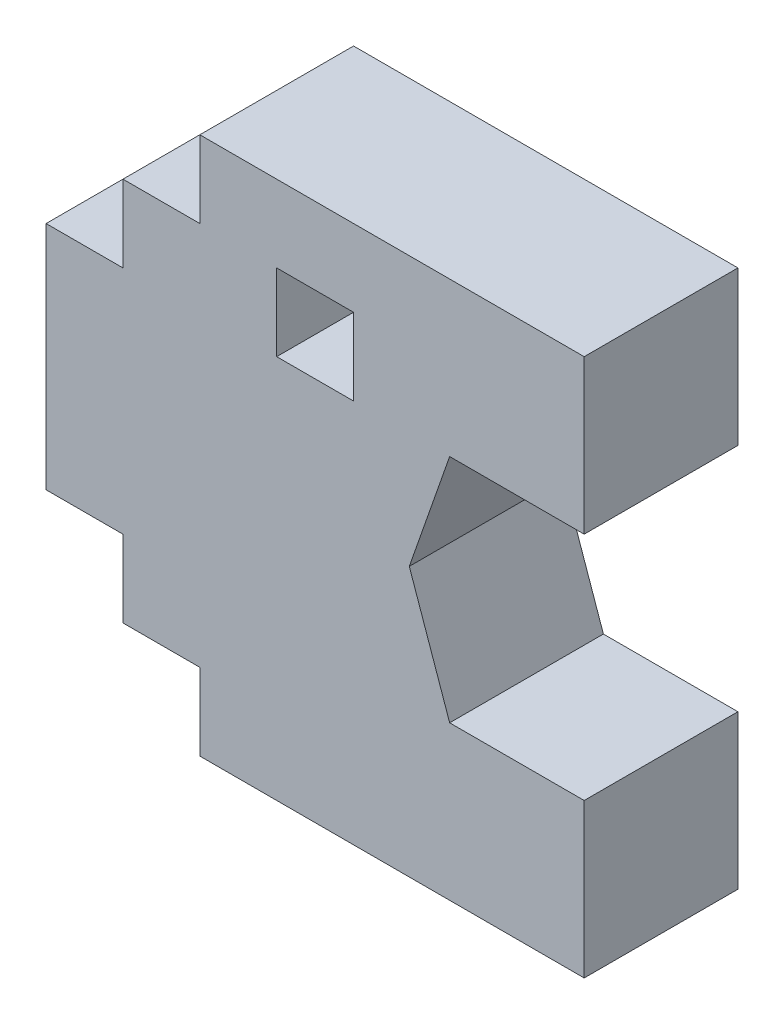
ISO-10303-21;
HEADER;
FILE_DESCRIPTION(('STEP AP214'),'2;1');
FILE_NAME('part.step','',(''),(''),'','','');
FILE_SCHEMA(('AUTOMOTIVE_DESIGN { 1 0 10303 214 1 1 1 1 }'));
ENDSEC;
DATA;
#1=APPLICATION_CONTEXT('core data for automotive mechanical design processes');
#2=APPLICATION_PROTOCOL_DEFINITION('international standard','automotive_design',2000,#1);
#3=PRODUCT_CONTEXT('',#1,'mechanical');
#4=PRODUCT('Part','Part','',(#3));
#5=PRODUCT_RELATED_PRODUCT_CATEGORY('part','',(#4));
#6=PRODUCT_DEFINITION_FORMATION('','',#4);
#7=PRODUCT_DEFINITION_CONTEXT('part definition',#1,'design');
#8=PRODUCT_DEFINITION('design','',#6,#7);
#9=PRODUCT_DEFINITION_SHAPE('','',#8);
#10=(LENGTH_UNIT() NAMED_UNIT(*) SI_UNIT(.MILLI.,.METRE.));
#11=(NAMED_UNIT(*) PLANE_ANGLE_UNIT() SI_UNIT($,.RADIAN.));
#12=(NAMED_UNIT(*) SI_UNIT($,.STERADIAN.) SOLID_ANGLE_UNIT());
#13=UNCERTAINTY_MEASURE_WITH_UNIT(LENGTH_MEASURE(1.E-05),#10,'distance_accuracy_value','');
#14=(GEOMETRIC_REPRESENTATION_CONTEXT(3) GLOBAL_UNCERTAINTY_ASSIGNED_CONTEXT((#13)) GLOBAL_UNIT_ASSIGNED_CONTEXT((#10,
#11,#12)) REPRESENTATION_CONTEXT('',''));
#15=CARTESIAN_POINT('',(0.,0.,0.));
#16=DIRECTION('',(0.,0.,1.));
#17=DIRECTION('',(1.,0.,0.));
#18=AXIS2_PLACEMENT_3D('',#15,#16,#17);
#19=CARTESIAN_POINT('',(30.,140.,40.));
#20=DIRECTION('',(0.,1.,0.));
#21=DIRECTION('',(0.,0.,1.));
#22=AXIS2_PLACEMENT_3D('',#19,#20,#21);
#23=PLANE('',#22);
#24=DIRECTION('',(1.,0.,0.));
#25=VECTOR('',#24,1.);
#26=CARTESIAN_POINT('',(30.,140.,0.));
#27=LINE('',#26,#25);
#28=CARTESIAN_POINT('',(0.,140.,0.));
#29=VERTEX_POINT('',#28);
#30=CARTESIAN_POINT('',(100.,140.,0.));
#31=VERTEX_POINT('',#30);
#32=EDGE_CURVE('E203',#29,#31,#27,.T.);
#33=ORIENTED_EDGE('',*,*,#32,.F.);
#34=DIRECTION('',(0.,0.,-1.));
#35=VECTOR('',#34,1.);
#36=CARTESIAN_POINT('',(0.,140.,40.));
#37=LINE('',#36,#35);
#38=CARTESIAN_POINT('',(0.,140.,40.));
#39=VERTEX_POINT('',#38);
#40=EDGE_CURVE('E11',#39,#29,#37,.T.);
#41=ORIENTED_EDGE('',*,*,#40,.F.);
#42=DIRECTION('',(1.,0.,0.));
#43=VECTOR('',#42,1.);
#44=CARTESIAN_POINT('',(30.,140.,40.));
#45=LINE('',#44,#43);
#46=CARTESIAN_POINT('',(100.,140.,40.));
#47=VERTEX_POINT('',#46);
#48=EDGE_CURVE('E261',#39,#47,#45,.T.);
#49=ORIENTED_EDGE('',*,*,#48,.T.);
#50=DIRECTION('',(0.,0.,-1.));
#51=VECTOR('',#50,1.);
#52=CARTESIAN_POINT('',(100.,140.,40.));
#53=LINE('',#52,#51);
#54=EDGE_CURVE('E47',#47,#31,#53,.T.);
#55=ORIENTED_EDGE('',*,*,#54,.T.);
#56=EDGE_LOOP('',(#33,#41,#49,#55));
#57=FACE_BOUND('',#56,.T.);
#58=ADVANCED_FACE('F30',(#57),#23,.T.);
#59=CARTESIAN_POINT('',(0.,-84.1414213562373,40.));
#60=DIRECTION('',(-1.,0.,0.));
#61=DIRECTION('',(0.,-1.,0.));
#62=AXIS2_PLACEMENT_3D('',#59,#60,#61);
#63=PLANE('',#62);
#64=DIRECTION('',(0.,1.,0.));
#65=VECTOR('',#64,1.);
#66=CARTESIAN_POINT('',(0.,-84.1414213562373,0.));
#67=LINE('',#66,#65);
#68=CARTESIAN_POINT('',(0.,120.,0.));
#69=VERTEX_POINT('',#68);
#70=EDGE_CURVE('E206',#69,#29,#67,.T.);
#71=ORIENTED_EDGE('',*,*,#70,.F.);
#72=DIRECTION('',(0.,0.,-1.));
#73=VECTOR('',#72,1.);
#74=CARTESIAN_POINT('',(0.,120.,40.));
#75=LINE('',#74,#73);
#76=CARTESIAN_POINT('',(0.,120.,40.));
#77=VERTEX_POINT('',#76);
#78=EDGE_CURVE('E39',#77,#69,#75,.T.);
#79=ORIENTED_EDGE('',*,*,#78,.F.);
#80=DIRECTION('',(0.,1.,0.));
#81=VECTOR('',#80,1.);
#82=CARTESIAN_POINT('',(0.,-84.1414213562373,40.));
#83=LINE('',#82,#81);
#84=EDGE_CURVE('E263',#77,#39,#83,.T.);
#85=ORIENTED_EDGE('',*,*,#84,.T.);
#86=ORIENTED_EDGE('',*,*,#40,.T.);
#87=EDGE_LOOP('',(#71,#79,#85,#86));
#88=FACE_BOUND('',#87,.T.);
#89=ADVANCED_FACE('F369',(#88),#63,.T.);
#90=CARTESIAN_POINT('',(30.,120.,40.));
#91=DIRECTION('',(0.,1.,0.));
#92=DIRECTION('',(0.,0.,1.));
#93=AXIS2_PLACEMENT_3D('',#90,#91,#92);
#94=PLANE('',#93);
#95=DIRECTION('',(1.,0.,0.));
#96=VECTOR('',#95,1.);
#97=CARTESIAN_POINT('',(30.,120.,0.));
#98=LINE('',#97,#96);
#99=CARTESIAN_POINT('',(-20.,120.,0.));
#100=VERTEX_POINT('',#99);
#101=EDGE_CURVE('E209',#100,#69,#98,.T.);
#102=ORIENTED_EDGE('',*,*,#101,.F.);
#103=DIRECTION('',(0.,0.,-1.));
#104=VECTOR('',#103,1.);
#105=CARTESIAN_POINT('',(-20.,120.,40.));
#106=LINE('',#105,#104);
#107=CARTESIAN_POINT('',(-20.,120.,40.));
#108=VERTEX_POINT('',#107);
#109=EDGE_CURVE('E342',#108,#100,#106,.T.);
#110=ORIENTED_EDGE('',*,*,#109,.F.);
#111=DIRECTION('',(1.,0.,0.));
#112=VECTOR('',#111,1.);
#113=CARTESIAN_POINT('',(30.,120.,40.));
#114=LINE('',#113,#112);
#115=EDGE_CURVE('E266',#108,#77,#114,.T.);
#116=ORIENTED_EDGE('',*,*,#115,.T.);
#117=ORIENTED_EDGE('',*,*,#78,.T.);
#118=EDGE_LOOP('',(#102,#110,#116,#117));
#119=FACE_BOUND('',#118,.T.);
#120=ADVANCED_FACE('F374',(#119),#94,.T.);
#121=CARTESIAN_POINT('',(-20.,-84.1414213562373,40.));
#122=DIRECTION('',(-1.,0.,0.));
#123=DIRECTION('',(0.,-1.,0.));
#124=AXIS2_PLACEMENT_3D('',#121,#122,#123);
#125=PLANE('',#124);
#126=DIRECTION('',(0.,1.,0.));
#127=VECTOR('',#126,1.);
#128=CARTESIAN_POINT('',(-20.,-84.1414213562373,0.));
#129=LINE('',#128,#127);
#130=CARTESIAN_POINT('',(-20.,100.,0.));
#131=VERTEX_POINT('',#130);
#132=EDGE_CURVE('E212',#131,#100,#129,.T.);
#133=ORIENTED_EDGE('',*,*,#132,.F.);
#134=DIRECTION('',(0.,0.,-1.));
#135=VECTOR('',#134,1.);
#136=CARTESIAN_POINT('',(-20.,100.,40.));
#137=LINE('',#136,#135);
#138=CARTESIAN_POINT('',(-20.,100.,40.));
#139=VERTEX_POINT('',#138);
#140=EDGE_CURVE('E340',#139,#131,#137,.T.);
#141=ORIENTED_EDGE('',*,*,#140,.F.);
#142=DIRECTION('',(0.,1.,0.));
#143=VECTOR('',#142,1.);
#144=CARTESIAN_POINT('',(-20.,-84.1414213562373,40.));
#145=LINE('',#144,#143);
#146=EDGE_CURVE('E269',#139,#108,#145,.T.);
#147=ORIENTED_EDGE('',*,*,#146,.T.);
#148=ORIENTED_EDGE('',*,*,#109,.T.);
#149=EDGE_LOOP('',(#133,#141,#147,#148));
#150=FACE_BOUND('',#149,.T.);
#151=ADVANCED_FACE('F381',(#150),#125,.T.);
#152=CARTESIAN_POINT('',(30.,100.,40.));
#153=DIRECTION('',(0.,1.,0.));
#154=DIRECTION('',(0.,0.,1.));
#155=AXIS2_PLACEMENT_3D('',#152,#153,#154);
#156=PLANE('',#155);
#157=DIRECTION('',(1.,0.,0.));
#158=VECTOR('',#157,1.);
#159=CARTESIAN_POINT('',(30.,100.,0.));
#160=LINE('',#159,#158);
#161=CARTESIAN_POINT('',(-40.,100.,0.));
#162=VERTEX_POINT('',#161);
#163=EDGE_CURVE('E215',#162,#131,#160,.T.);
#164=ORIENTED_EDGE('',*,*,#163,.F.);
#165=DIRECTION('',(0.,0.,-1.));
#166=VECTOR('',#165,1.);
#167=CARTESIAN_POINT('',(-40.,100.,40.));
#168=LINE('',#167,#166);
#169=CARTESIAN_POINT('',(-40.,100.,40.));
#170=VERTEX_POINT('',#169);
#171=EDGE_CURVE('E338',#170,#162,#168,.T.);
#172=ORIENTED_EDGE('',*,*,#171,.F.);
#173=DIRECTION('',(1.,0.,0.));
#174=VECTOR('',#173,1.);
#175=CARTESIAN_POINT('',(30.,100.,40.));
#176=LINE('',#175,#174);
#177=EDGE_CURVE('E272',#170,#139,#176,.T.);
#178=ORIENTED_EDGE('',*,*,#177,.T.);
#179=ORIENTED_EDGE('',*,*,#140,.T.);
#180=EDGE_LOOP('',(#164,#172,#178,#179));
#181=FACE_BOUND('',#180,.T.);
#182=ADVANCED_FACE('F385',(#181),#156,.T.);
#183=CARTESIAN_POINT('',(-40.,-84.1414213562373,40.));
#184=DIRECTION('',(1.,0.,0.));
#185=DIRECTION('',(0.,0.,-1.));
#186=AXIS2_PLACEMENT_3D('',#183,#184,#185);
#187=PLANE('',#186);
#188=DIRECTION('',(0.,-1.,0.));
#189=VECTOR('',#188,1.);
#190=CARTESIAN_POINT('',(-40.,-84.1414213562373,0.));
#191=LINE('',#190,#189);
#192=CARTESIAN_POINT('',(-40.,40.,0.));
#193=VERTEX_POINT('',#192);
#194=EDGE_CURVE('E218',#162,#193,#191,.T.);
#195=ORIENTED_EDGE('',*,*,#194,.T.);
#196=DIRECTION('',(0.,0.,-1.));
#197=VECTOR('',#196,1.);
#198=CARTESIAN_POINT('',(-40.,40.,40.));
#199=LINE('',#198,#197);
#200=CARTESIAN_POINT('',(-40.,40.,40.));
#201=VERTEX_POINT('',#200);
#202=EDGE_CURVE('E335',#201,#193,#199,.T.);
#203=ORIENTED_EDGE('',*,*,#202,.F.);
#204=DIRECTION('',(0.,-1.,0.));
#205=VECTOR('',#204,1.);
#206=CARTESIAN_POINT('',(-40.,-84.1414213562373,40.));
#207=LINE('',#206,#205);
#208=EDGE_CURVE('E275',#170,#201,#207,.T.);
#209=ORIENTED_EDGE('',*,*,#208,.F.);
#210=ORIENTED_EDGE('',*,*,#171,.T.);
#211=EDGE_LOOP('',(#195,#203,#209,#210));
#212=FACE_BOUND('',#211,.T.);
#213=ADVANCED_FACE('F389',(#212),#187,.F.);
#214=CARTESIAN_POINT('',(30.,40.,40.));
#215=DIRECTION('',(0.,1.,0.));
#216=DIRECTION('',(0.,0.,1.));
#217=AXIS2_PLACEMENT_3D('',#214,#215,#216);
#218=PLANE('',#217);
#219=DIRECTION('',(1.,0.,0.));
#220=VECTOR('',#219,1.);
#221=CARTESIAN_POINT('',(30.,40.,0.));
#222=LINE('',#221,#220);
#223=CARTESIAN_POINT('',(-20.,40.,0.));
#224=VERTEX_POINT('',#223);
#225=EDGE_CURVE('E221',#193,#224,#222,.T.);
#226=ORIENTED_EDGE('',*,*,#225,.T.);
#227=DIRECTION('',(0.,0.,-1.));
#228=VECTOR('',#227,1.);
#229=CARTESIAN_POINT('',(-20.,40.,40.));
#230=LINE('',#229,#228);
#231=CARTESIAN_POINT('',(-20.,40.,40.));
#232=VERTEX_POINT('',#231);
#233=EDGE_CURVE('E332',#232,#224,#230,.T.);
#234=ORIENTED_EDGE('',*,*,#233,.F.);
#235=DIRECTION('',(1.,0.,0.));
#236=VECTOR('',#235,1.);
#237=CARTESIAN_POINT('',(30.,40.,40.));
#238=LINE('',#237,#236);
#239=EDGE_CURVE('E278',#201,#232,#238,.T.);
#240=ORIENTED_EDGE('',*,*,#239,.F.);
#241=ORIENTED_EDGE('',*,*,#202,.T.);
#242=EDGE_LOOP('',(#226,#234,#240,#241));
#243=FACE_BOUND('',#242,.T.);
#244=ADVANCED_FACE('F393',(#243),#218,.F.);
#245=CARTESIAN_POINT('',(-20.,-84.1414213562373,40.));
#246=DIRECTION('',(1.,0.,0.));
#247=DIRECTION('',(0.,1.,0.));
#248=AXIS2_PLACEMENT_3D('',#245,#246,#247);
#249=PLANE('',#248);
#250=DIRECTION('',(0.,-1.,0.));
#251=VECTOR('',#250,1.);
#252=CARTESIAN_POINT('',(-20.,-84.1414213562373,0.));
#253=LINE('',#252,#251);
#254=CARTESIAN_POINT('',(-20.,20.,0.));
#255=VERTEX_POINT('',#254);
#256=EDGE_CURVE('E224',#224,#255,#253,.T.);
#257=ORIENTED_EDGE('',*,*,#256,.T.);
#258=DIRECTION('',(0.,0.,-1.));
#259=VECTOR('',#258,1.);
#260=CARTESIAN_POINT('',(-20.,20.,40.));
#261=LINE('',#260,#259);
#262=CARTESIAN_POINT('',(-20.,20.,40.));
#263=VERTEX_POINT('',#262);
#264=EDGE_CURVE('E329',#263,#255,#261,.T.);
#265=ORIENTED_EDGE('',*,*,#264,.F.);
#266=DIRECTION('',(0.,-1.,0.));
#267=VECTOR('',#266,1.);
#268=CARTESIAN_POINT('',(-20.,-84.1414213562373,40.));
#269=LINE('',#268,#267);
#270=EDGE_CURVE('E281',#232,#263,#269,.T.);
#271=ORIENTED_EDGE('',*,*,#270,.F.);
#272=ORIENTED_EDGE('',*,*,#233,.T.);
#273=EDGE_LOOP('',(#257,#265,#271,#272));
#274=FACE_BOUND('',#273,.T.);
#275=ADVANCED_FACE('F397',(#274),#249,.F.);
#276=CARTESIAN_POINT('',(30.,20.,40.));
#277=DIRECTION('',(0.,1.,0.));
#278=DIRECTION('',(0.,0.,1.));
#279=AXIS2_PLACEMENT_3D('',#276,#277,#278);
#280=PLANE('',#279);
#281=DIRECTION('',(1.,0.,0.));
#282=VECTOR('',#281,1.);
#283=CARTESIAN_POINT('',(30.,20.,0.));
#284=LINE('',#283,#282);
#285=CARTESIAN_POINT('',(0.,20.,0.));
#286=VERTEX_POINT('',#285);
#287=EDGE_CURVE('E227',#255,#286,#284,.T.);
#288=ORIENTED_EDGE('',*,*,#287,.T.);
#289=DIRECTION('',(0.,0.,-1.));
#290=VECTOR('',#289,1.);
#291=CARTESIAN_POINT('',(0.,20.,40.));
#292=LINE('',#291,#290);
#293=CARTESIAN_POINT('',(0.,20.,40.));
#294=VERTEX_POINT('',#293);
#295=EDGE_CURVE('E326',#294,#286,#292,.T.);
#296=ORIENTED_EDGE('',*,*,#295,.F.);
#297=DIRECTION('',(1.,0.,0.));
#298=VECTOR('',#297,1.);
#299=CARTESIAN_POINT('',(30.,20.,40.));
#300=LINE('',#299,#298);
#301=EDGE_CURVE('E284',#263,#294,#300,.T.);
#302=ORIENTED_EDGE('',*,*,#301,.F.);
#303=ORIENTED_EDGE('',*,*,#264,.T.);
#304=EDGE_LOOP('',(#288,#296,#302,#303));
#305=FACE_BOUND('',#304,.T.);
#306=ADVANCED_FACE('F401',(#305),#280,.F.);
#307=CARTESIAN_POINT('',(0.,-84.1414213562373,40.));
#308=DIRECTION('',(1.,0.,0.));
#309=DIRECTION('',(0.,1.,0.));
#310=AXIS2_PLACEMENT_3D('',#307,#308,#309);
#311=PLANE('',#310);
#312=DIRECTION('',(0.,-1.,0.));
#313=VECTOR('',#312,1.);
#314=CARTESIAN_POINT('',(0.,-84.1414213562373,0.));
#315=LINE('',#314,#313);
#316=CARTESIAN_POINT('',(0.,0.,0.));
#317=VERTEX_POINT('',#316);
#318=EDGE_CURVE('E230',#286,#317,#315,.T.);
#319=ORIENTED_EDGE('',*,*,#318,.T.);
#320=DIRECTION('',(0.,0.,-1.));
#321=VECTOR('',#320,1.);
#322=CARTESIAN_POINT('',(0.,0.,40.));
#323=LINE('',#322,#321);
#324=CARTESIAN_POINT('',(0.,0.,40.));
#325=VERTEX_POINT('',#324);
#326=EDGE_CURVE('E323',#325,#317,#323,.T.);
#327=ORIENTED_EDGE('',*,*,#326,.F.);
#328=DIRECTION('',(0.,-1.,0.));
#329=VECTOR('',#328,1.);
#330=CARTESIAN_POINT('',(0.,-84.1414213562373,40.));
#331=LINE('',#330,#329);
#332=EDGE_CURVE('E287',#294,#325,#331,.T.);
#333=ORIENTED_EDGE('',*,*,#332,.F.);
#334=ORIENTED_EDGE('',*,*,#295,.T.);
#335=EDGE_LOOP('',(#319,#327,#333,#334));
#336=FACE_BOUND('',#335,.T.);
#337=ADVANCED_FACE('F405',(#336),#311,.F.);
#338=CARTESIAN_POINT('',(30.,0.,40.));
#339=DIRECTION('',(0.,1.,0.));
#340=DIRECTION('',(0.,0.,1.));
#341=AXIS2_PLACEMENT_3D('',#338,#339,#340);
#342=PLANE('',#341);
#343=DIRECTION('',(1.,0.,0.));
#344=VECTOR('',#343,1.);
#345=CARTESIAN_POINT('',(30.,0.,0.));
#346=LINE('',#345,#344);
#347=CARTESIAN_POINT('',(100.,0.,0.));
#348=VERTEX_POINT('',#347);
#349=EDGE_CURVE('E233',#317,#348,#346,.T.);
#350=ORIENTED_EDGE('',*,*,#349,.T.);
#351=DIRECTION('',(0.,0.,-1.));
#352=VECTOR('',#351,1.);
#353=CARTESIAN_POINT('',(100.,0.,40.));
#354=LINE('',#353,#352);
#355=CARTESIAN_POINT('',(100.,0.,40.));
#356=VERTEX_POINT('',#355);
#357=EDGE_CURVE('E320',#356,#348,#354,.T.);
#358=ORIENTED_EDGE('',*,*,#357,.F.);
#359=DIRECTION('',(1.,0.,0.));
#360=VECTOR('',#359,1.);
#361=CARTESIAN_POINT('',(30.,0.,40.));
#362=LINE('',#361,#360);
#363=EDGE_CURVE('E290',#325,#356,#362,.T.);
#364=ORIENTED_EDGE('',*,*,#363,.F.);
#365=ORIENTED_EDGE('',*,*,#326,.T.);
#366=EDGE_LOOP('',(#350,#358,#364,#365));
#367=FACE_BOUND('',#366,.T.);
#368=ADVANCED_FACE('F409',(#367),#342,.F.);
#369=CARTESIAN_POINT('',(100.,-84.1414213562373,40.));
#370=DIRECTION('',(-1.,0.,0.));
#371=DIRECTION('',(0.,0.,1.));
#372=AXIS2_PLACEMENT_3D('',#369,#370,#371);
#373=PLANE('',#372);
#374=DIRECTION('',(0.,1.,0.));
#375=VECTOR('',#374,1.);
#376=CARTESIAN_POINT('',(100.,-84.1414213562373,0.));
#377=LINE('',#376,#375);
#378=CARTESIAN_POINT('',(100.,40.,0.));
#379=VERTEX_POINT('',#378);
#380=EDGE_CURVE('E236',#348,#379,#377,.T.);
#381=ORIENTED_EDGE('',*,*,#380,.T.);
#382=DIRECTION('',(0.,0.,-1.));
#383=VECTOR('',#382,1.);
#384=CARTESIAN_POINT('',(100.,40.,40.));
#385=LINE('',#384,#383);
#386=CARTESIAN_POINT('',(100.,40.,40.));
#387=VERTEX_POINT('',#386);
#388=EDGE_CURVE('E317',#387,#379,#385,.T.);
#389=ORIENTED_EDGE('',*,*,#388,.F.);
#390=DIRECTION('',(0.,1.,0.));
#391=VECTOR('',#390,1.);
#392=CARTESIAN_POINT('',(100.,-84.1414213562373,40.));
#393=LINE('',#392,#391);
#394=EDGE_CURVE('E293',#356,#387,#393,.T.);
#395=ORIENTED_EDGE('',*,*,#394,.F.);
#396=ORIENTED_EDGE('',*,*,#357,.T.);
#397=EDGE_LOOP('',(#381,#389,#395,#396));
#398=FACE_BOUND('',#397,.T.);
#399=ADVANCED_FACE('F413',(#398),#373,.F.);
#400=CARTESIAN_POINT('',(30.,40.,40.));
#401=DIRECTION('',(0.,-1.,0.));
#402=DIRECTION('',(1.,0.,0.));
#403=AXIS2_PLACEMENT_3D('',#400,#401,#402);
#404=PLANE('',#403);
#405=DIRECTION('',(-1.,0.,0.));
#406=VECTOR('',#405,1.);
#407=CARTESIAN_POINT('',(30.,40.,0.));
#408=LINE('',#407,#406);
#409=CARTESIAN_POINT('',(65.,40.,0.));
#410=VERTEX_POINT('',#409);
#411=EDGE_CURVE('E239',#379,#410,#408,.T.);
#412=ORIENTED_EDGE('',*,*,#411,.T.);
#413=DIRECTION('',(0.,0.,-1.));
#414=VECTOR('',#413,1.);
#415=CARTESIAN_POINT('',(65.,40.,40.));
#416=LINE('',#415,#414);
#417=CARTESIAN_POINT('',(65.,40.,40.));
#418=VERTEX_POINT('',#417);
#419=EDGE_CURVE('E314',#418,#410,#416,.T.);
#420=ORIENTED_EDGE('',*,*,#419,.F.);
#421=DIRECTION('',(-1.,0.,0.));
#422=VECTOR('',#421,1.);
#423=CARTESIAN_POINT('',(30.,40.,40.));
#424=LINE('',#423,#422);
#425=EDGE_CURVE('E296',#387,#418,#424,.T.);
#426=ORIENTED_EDGE('',*,*,#425,.F.);
#427=ORIENTED_EDGE('',*,*,#388,.T.);
#428=EDGE_LOOP('',(#412,#420,#426,#427));
#429=FACE_BOUND('',#428,.T.);
#430=ADVANCED_FACE('F417',(#429),#404,.F.);
#431=CARTESIAN_POINT('',(99.8881937413657,-59.6805535467593,40.));
#432=DIRECTION('',(-0.943858356366017,-0.330350424728106,0.));
#433=DIRECTION('',(0.330350424728106,-0.943858356366017,0.));
#434=AXIS2_PLACEMENT_3D('',#431,#432,#433);
#435=PLANE('',#434);
#436=DIRECTION('',(-0.330350424728106,0.943858356366018,0.));
#437=VECTOR('',#436,1.);
#438=CARTESIAN_POINT('',(99.8881937413657,-59.6805535467593,0.));
#439=LINE('',#438,#437);
#440=CARTESIAN_POINT('',(54.5,70.,0.));
#441=VERTEX_POINT('',#440);
#442=EDGE_CURVE('E242',#410,#441,#439,.T.);
#443=ORIENTED_EDGE('',*,*,#442,.T.);
#444=DIRECTION('',(0.,0.,-1.));
#445=VECTOR('',#444,1.);
#446=CARTESIAN_POINT('',(54.5,70.,40.));
#447=LINE('',#446,#445);
#448=CARTESIAN_POINT('',(54.5,70.,40.));
#449=VERTEX_POINT('',#448);
#450=EDGE_CURVE('E312',#449,#441,#447,.T.);
#451=ORIENTED_EDGE('',*,*,#450,.F.);
#452=DIRECTION('',(-0.330350424728106,0.943858356366018,0.));
#453=VECTOR('',#452,1.);
#454=CARTESIAN_POINT('',(99.8881937413657,-59.6805535467593,40.));
#455=LINE('',#454,#453);
#456=EDGE_CURVE('E299',#418,#449,#455,.T.);
#457=ORIENTED_EDGE('',*,*,#456,.F.);
#458=ORIENTED_EDGE('',*,*,#419,.T.);
#459=EDGE_LOOP('',(#443,#451,#457,#458));
#460=FACE_BOUND('',#459,.T.);
#461=ADVANCED_FACE('F421',(#460),#435,.F.);
#462=CARTESIAN_POINT('',(3.76436750585028,-74.9589499832849,40.));
#463=DIRECTION('',(0.943858356366017,-0.330350424728106,0.));
#464=DIRECTION('',(0.330350424728106,0.943858356366017,0.));
#465=AXIS2_PLACEMENT_3D('',#462,#463,#464);
#466=PLANE('',#465);
#467=DIRECTION('',(-0.330350424728106,-0.943858356366018,0.));
#468=VECTOR('',#467,1.);
#469=CARTESIAN_POINT('',(3.76436750585028,-74.9589499832849,0.));
#470=LINE('',#469,#468);
#471=CARTESIAN_POINT('',(65.,100.,0.));
#472=VERTEX_POINT('',#471);
#473=EDGE_CURVE('E245',#472,#441,#470,.T.);
#474=ORIENTED_EDGE('',*,*,#473,.F.);
#475=DIRECTION('',(0.,0.,-1.));
#476=VECTOR('',#475,1.);
#477=CARTESIAN_POINT('',(65.,100.,40.));
#478=LINE('',#477,#476);
#479=CARTESIAN_POINT('',(65.,100.,40.));
#480=VERTEX_POINT('',#479);
#481=EDGE_CURVE('E310',#480,#472,#478,.T.);
#482=ORIENTED_EDGE('',*,*,#481,.F.);
#483=DIRECTION('',(-0.330350424728106,-0.943858356366018,0.));
#484=VECTOR('',#483,1.);
#485=CARTESIAN_POINT('',(3.76436750585028,-74.9589499832849,40.));
#486=LINE('',#485,#484);
#487=EDGE_CURVE('E301',#480,#449,#486,.T.);
#488=ORIENTED_EDGE('',*,*,#487,.T.);
#489=ORIENTED_EDGE('',*,*,#450,.T.);
#490=EDGE_LOOP('',(#474,#482,#488,#489));
#491=FACE_BOUND('',#490,.T.);
#492=ADVANCED_FACE('F425',(#491),#466,.T.);
#493=CARTESIAN_POINT('',(30.0000000000001,100.,40.));
#494=DIRECTION('',(0.,-1.,0.));
#495=DIRECTION('',(1.,0.,0.));
#496=AXIS2_PLACEMENT_3D('',#493,#494,#495);
#497=PLANE('',#496);
#498=DIRECTION('',(-1.,0.,0.));
#499=VECTOR('',#498,1.);
#500=CARTESIAN_POINT('',(30.0000000000001,100.,0.));
#501=LINE('',#500,#499);
#502=CARTESIAN_POINT('',(100.,100.,0.));
#503=VERTEX_POINT('',#502);
#504=EDGE_CURVE('E248',#503,#472,#501,.T.);
#505=ORIENTED_EDGE('',*,*,#504,.F.);
#506=DIRECTION('',(0.,0.,-1.));
#507=VECTOR('',#506,1.);
#508=CARTESIAN_POINT('',(100.,100.,40.));
#509=LINE('',#508,#507);
#510=CARTESIAN_POINT('',(100.,100.,40.));
#511=VERTEX_POINT('',#510);
#512=EDGE_CURVE('E55',#511,#503,#509,.T.);
#513=ORIENTED_EDGE('',*,*,#512,.F.);
#514=DIRECTION('',(-1.,0.,0.));
#515=VECTOR('',#514,1.);
#516=CARTESIAN_POINT('',(30.0000000000001,100.,40.));
#517=LINE('',#516,#515);
#518=EDGE_CURVE('E304',#511,#480,#517,.T.);
#519=ORIENTED_EDGE('',*,*,#518,.T.);
#520=ORIENTED_EDGE('',*,*,#481,.T.);
#521=EDGE_LOOP('',(#505,#513,#519,#520));
#522=FACE_BOUND('',#521,.T.);
#523=ADVANCED_FACE('F429',(#522),#497,.T.);
#524=CARTESIAN_POINT('',(30.,100.,40.));
#525=DIRECTION('',(0.,1.,0.));
#526=DIRECTION('',(0.,0.,1.));
#527=AXIS2_PLACEMENT_3D('',#524,#525,#526);
#528=PLANE('',#527);
#529=DIRECTION('',(1.,0.,0.));
#530=VECTOR('',#529,1.);
#531=CARTESIAN_POINT('',(30.,100.,0.));
#532=LINE('',#531,#530);
#533=CARTESIAN_POINT('',(20.,100.,0.));
#534=VERTEX_POINT('',#533);
#535=CARTESIAN_POINT('',(40.,100.,0.));
#536=VERTEX_POINT('',#535);
#537=EDGE_CURVE('E187',#534,#536,#532,.T.);
#538=ORIENTED_EDGE('',*,*,#537,.F.);
#539=DIRECTION('',(0.,0.,-1.));
#540=VECTOR('',#539,1.);
#541=CARTESIAN_POINT('',(20.,100.,40.));
#542=LINE('',#541,#540);
#543=CARTESIAN_POINT('',(20.,100.,40.));
#544=VERTEX_POINT('',#543);
#545=EDGE_CURVE('E34',#544,#534,#542,.T.);
#546=ORIENTED_EDGE('',*,*,#545,.F.);
#547=DIRECTION('',(1.,0.,0.));
#548=VECTOR('',#547,1.);
#549=CARTESIAN_POINT('',(30.,100.,40.));
#550=LINE('',#549,#548);
#551=CARTESIAN_POINT('',(40.,100.,40.));
#552=VERTEX_POINT('',#551);
#553=EDGE_CURVE('E254',#544,#552,#550,.T.);
#554=ORIENTED_EDGE('',*,*,#553,.T.);
#555=DIRECTION('',(0.,0.,-1.));
#556=VECTOR('',#555,1.);
#557=CARTESIAN_POINT('',(40.,100.,40.));
#558=LINE('',#557,#556);
#559=EDGE_CURVE('E189',#552,#536,#558,.T.);
#560=ORIENTED_EDGE('',*,*,#559,.T.);
#561=EDGE_LOOP('',(#538,#546,#554,#560));
#562=FACE_BOUND('',#561,.T.);
#563=ADVANCED_FACE('F32',(#562),#528,.T.);
#564=CARTESIAN_POINT('',(20.,-84.1414213562373,40.));
#565=DIRECTION('',(1.,0.,0.));
#566=DIRECTION('',(0.,0.,-1.));
#567=AXIS2_PLACEMENT_3D('',#564,#565,#566);
#568=PLANE('',#567);
#569=DIRECTION('',(0.,-1.,0.));
#570=VECTOR('',#569,1.);
#571=CARTESIAN_POINT('',(20.,-84.1414213562373,0.));
#572=LINE('',#571,#570);
#573=CARTESIAN_POINT('',(20.,120.,0.));
#574=VERTEX_POINT('',#573);
#575=EDGE_CURVE('E179',#574,#534,#572,.T.);
#576=ORIENTED_EDGE('',*,*,#575,.F.);
#577=DIRECTION('',(0.,0.,-1.));
#578=VECTOR('',#577,1.);
#579=CARTESIAN_POINT('',(20.,120.,40.));
#580=LINE('',#579,#578);
#581=CARTESIAN_POINT('',(20.,120.,40.));
#582=VERTEX_POINT('',#581);
#583=EDGE_CURVE('E185',#582,#574,#580,.T.);
#584=ORIENTED_EDGE('',*,*,#583,.F.);
#585=DIRECTION('',(0.,-1.,0.));
#586=VECTOR('',#585,1.);
#587=CARTESIAN_POINT('',(20.,-84.1414213562373,40.));
#588=LINE('',#587,#586);
#589=EDGE_CURVE('E181',#582,#544,#588,.T.);
#590=ORIENTED_EDGE('',*,*,#589,.T.);
#591=ORIENTED_EDGE('',*,*,#545,.T.);
#592=EDGE_LOOP('',(#576,#584,#590,#591));
#593=FACE_BOUND('',#592,.T.);
#594=ADVANCED_FACE('F177',(#593),#568,.T.);
#595=CARTESIAN_POINT('',(30.,120.,40.));
#596=DIRECTION('',(0.,1.,0.));
#597=DIRECTION('',(0.,0.,1.));
#598=AXIS2_PLACEMENT_3D('',#595,#596,#597);
#599=PLANE('',#598);
#600=DIRECTION('',(1.,0.,0.));
#601=VECTOR('',#600,1.);
#602=CARTESIAN_POINT('',(30.,120.,0.));
#603=LINE('',#602,#601);
#604=CARTESIAN_POINT('',(40.,120.,0.));
#605=VERTEX_POINT('',#604);
#606=EDGE_CURVE('E197',#574,#605,#603,.T.);
#607=ORIENTED_EDGE('',*,*,#606,.T.);
#608=DIRECTION('',(0.,0.,-1.));
#609=VECTOR('',#608,1.);
#610=CARTESIAN_POINT('',(40.,120.,40.));
#611=LINE('',#610,#609);
#612=CARTESIAN_POINT('',(40.,120.,40.));
#613=VERTEX_POINT('',#612);
#614=EDGE_CURVE('E346',#613,#605,#611,.T.);
#615=ORIENTED_EDGE('',*,*,#614,.F.);
#616=DIRECTION('',(1.,0.,0.));
#617=VECTOR('',#616,1.);
#618=CARTESIAN_POINT('',(30.,120.,40.));
#619=LINE('',#618,#617);
#620=EDGE_CURVE('E257',#582,#613,#619,.T.);
#621=ORIENTED_EDGE('',*,*,#620,.F.);
#622=ORIENTED_EDGE('',*,*,#583,.T.);
#623=EDGE_LOOP('',(#607,#615,#621,#622));
#624=FACE_BOUND('',#623,.T.);
#625=ADVANCED_FACE('F350',(#624),#599,.F.);
#626=CARTESIAN_POINT('',(40.,-84.1414213562373,40.));
#627=DIRECTION('',(1.,0.,0.));
#628=DIRECTION('',(0.,0.,-1.));
#629=AXIS2_PLACEMENT_3D('',#626,#627,#628);
#630=PLANE('',#629);
#631=DIRECTION('',(0.,-1.,0.));
#632=VECTOR('',#631,1.);
#633=CARTESIAN_POINT('',(40.,-84.1414213562373,0.));
#634=LINE('',#633,#632);
#635=EDGE_CURVE('E199',#605,#536,#634,.T.);
#636=ORIENTED_EDGE('',*,*,#635,.T.);
#637=ORIENTED_EDGE('',*,*,#559,.F.);
#638=DIRECTION('',(0.,-1.,0.));
#639=VECTOR('',#638,1.);
#640=CARTESIAN_POINT('',(40.,-84.1414213562373,40.));
#641=LINE('',#640,#639);
#642=EDGE_CURVE('E259',#613,#552,#641,.T.);
#643=ORIENTED_EDGE('',*,*,#642,.F.);
#644=ORIENTED_EDGE('',*,*,#614,.T.);
#645=EDGE_LOOP('',(#636,#637,#643,#644));
#646=FACE_BOUND('',#645,.T.);
#647=ADVANCED_FACE('F357',(#646),#630,.F.);
#648=CARTESIAN_POINT('',(100.,-84.1414213562373,40.));
#649=DIRECTION('',(1.,0.,0.));
#650=DIRECTION('',(0.,0.,-1.));
#651=AXIS2_PLACEMENT_3D('',#648,#649,#650);
#652=PLANE('',#651);
#653=DIRECTION('',(0.,-1.,0.));
#654=VECTOR('',#653,1.);
#655=CARTESIAN_POINT('',(100.,-84.1414213562373,0.));
#656=LINE('',#655,#654);
#657=EDGE_CURVE('E251',#31,#503,#656,.T.);
#658=ORIENTED_EDGE('',*,*,#657,.F.);
#659=ORIENTED_EDGE('',*,*,#54,.F.);
#660=DIRECTION('',(0.,-1.,0.));
#661=VECTOR('',#660,1.);
#662=CARTESIAN_POINT('',(100.,-84.1414213562373,40.));
#663=LINE('',#662,#661);
#664=EDGE_CURVE('E306',#47,#511,#663,.T.);
#665=ORIENTED_EDGE('',*,*,#664,.T.);
#666=ORIENTED_EDGE('',*,*,#512,.T.);
#667=EDGE_LOOP('',(#658,#659,#665,#666));
#668=FACE_BOUND('',#667,.T.);
#669=ADVANCED_FACE('F359',(#668),#652,.T.);
#670=CARTESIAN_POINT('',(30.,-84.1414213562373,40.));
#671=DIRECTION('',(0.,0.,1.));
#672=DIRECTION('',(1.,0.,0.));
#673=AXIS2_PLACEMENT_3D('',#670,#671,#672);
#674=PLANE('',#673);
#675=ORIENTED_EDGE('',*,*,#553,.F.);
#676=ORIENTED_EDGE('',*,*,#589,.F.);
#677=ORIENTED_EDGE('',*,*,#620,.T.);
#678=ORIENTED_EDGE('',*,*,#642,.T.);
#679=EDGE_LOOP('',(#675,#676,#677,#678));
#680=FACE_BOUND('',#679,.T.);
#681=ORIENTED_EDGE('',*,*,#48,.F.);
#682=ORIENTED_EDGE('',*,*,#84,.F.);
#683=ORIENTED_EDGE('',*,*,#115,.F.);
#684=ORIENTED_EDGE('',*,*,#146,.F.);
#685=ORIENTED_EDGE('',*,*,#177,.F.);
#686=ORIENTED_EDGE('',*,*,#208,.T.);
#687=ORIENTED_EDGE('',*,*,#239,.T.);
#688=ORIENTED_EDGE('',*,*,#270,.T.);
#689=ORIENTED_EDGE('',*,*,#301,.T.);
#690=ORIENTED_EDGE('',*,*,#332,.T.);
#691=ORIENTED_EDGE('',*,*,#363,.T.);
#692=ORIENTED_EDGE('',*,*,#394,.T.);
#693=ORIENTED_EDGE('',*,*,#425,.T.);
#694=ORIENTED_EDGE('',*,*,#456,.T.);
#695=ORIENTED_EDGE('',*,*,#487,.F.);
#696=ORIENTED_EDGE('',*,*,#518,.F.);
#697=ORIENTED_EDGE('',*,*,#664,.F.);
#698=EDGE_LOOP('',(#681,#682,#683,#684,#685,#686,#687,#688,#689,#690,#691,#692,#693,#694,#695,
#696,#697));
#699=FACE_BOUND('',#698,.T.);
#700=ADVANCED_FACE('F354',(#680,#699),#674,.T.);
#701=CARTESIAN_POINT('',(30.,-84.1414213562373,0.));
#702=DIRECTION('',(0.,0.,1.));
#703=DIRECTION('',(1.,0.,0.));
#704=AXIS2_PLACEMENT_3D('',#701,#702,#703);
#705=PLANE('',#704);
#706=ORIENTED_EDGE('',*,*,#537,.T.);
#707=ORIENTED_EDGE('',*,*,#635,.F.);
#708=ORIENTED_EDGE('',*,*,#606,.F.);
#709=ORIENTED_EDGE('',*,*,#575,.T.);
#710=EDGE_LOOP('',(#706,#707,#708,#709));
#711=FACE_BOUND('',#710,.T.);
#712=ORIENTED_EDGE('',*,*,#32,.T.);
#713=ORIENTED_EDGE('',*,*,#657,.T.);
#714=ORIENTED_EDGE('',*,*,#504,.T.);
#715=ORIENTED_EDGE('',*,*,#473,.T.);
#716=ORIENTED_EDGE('',*,*,#442,.F.);
#717=ORIENTED_EDGE('',*,*,#411,.F.);
#718=ORIENTED_EDGE('',*,*,#380,.F.);
#719=ORIENTED_EDGE('',*,*,#349,.F.);
#720=ORIENTED_EDGE('',*,*,#318,.F.);
#721=ORIENTED_EDGE('',*,*,#287,.F.);
#722=ORIENTED_EDGE('',*,*,#256,.F.);
#723=ORIENTED_EDGE('',*,*,#225,.F.);
#724=ORIENTED_EDGE('',*,*,#194,.F.);
#725=ORIENTED_EDGE('',*,*,#163,.T.);
#726=ORIENTED_EDGE('',*,*,#132,.T.);
#727=ORIENTED_EDGE('',*,*,#101,.T.);
#728=ORIENTED_EDGE('',*,*,#70,.T.);
#729=EDGE_LOOP('',(#712,#713,#714,#715,#716,#717,#718,#719,#720,#721,#722,#723,#724,#725,#726,
#727,#728));
#730=FACE_BOUND('',#729,.T.);
#731=ADVANCED_FACE('F195',(#711,#730),#705,.F.);
#732=CLOSED_SHELL('',(#58,#89,#120,#151,#182,#213,#244,#275,#306,#337,#368,#399,#430,#461,#492,
#523,#563,#594,#625,#647,#669,#700,#731));
#733=MANIFOLD_SOLID_BREP('B2',#732);
#734=ADVANCED_BREP_SHAPE_REPRESENTATION('',(#18,#733),#14);
#735=SHAPE_DEFINITION_REPRESENTATION(#9,#734);
ENDSEC;
END-ISO-10303-21;
